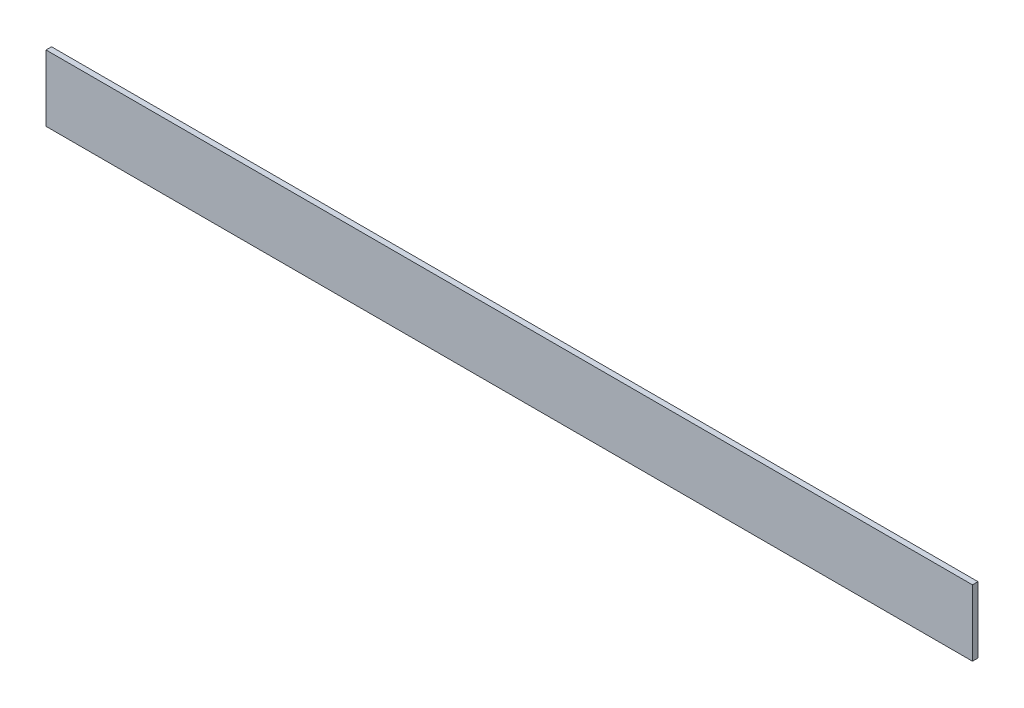
ISO-10303-21;
HEADER;
FILE_DESCRIPTION(('STEP AP214'),'2;1');
FILE_NAME('part.step','',(''),(''),'','','');
FILE_SCHEMA(('AUTOMOTIVE_DESIGN { 1 0 10303 214 1 1 1 1 }'));
ENDSEC;
DATA;
#1=APPLICATION_CONTEXT('core data for automotive mechanical design processes');
#2=APPLICATION_PROTOCOL_DEFINITION('international standard','automotive_design',2000,#1);
#3=PRODUCT_CONTEXT('',#1,'mechanical');
#4=PRODUCT('Part','Part','',(#3));
#5=PRODUCT_RELATED_PRODUCT_CATEGORY('part','',(#4));
#6=PRODUCT_DEFINITION_FORMATION('','',#4);
#7=PRODUCT_DEFINITION_CONTEXT('part definition',#1,'design');
#8=PRODUCT_DEFINITION('design','',#6,#7);
#9=PRODUCT_DEFINITION_SHAPE('','',#8);
#10=(LENGTH_UNIT() NAMED_UNIT(*) SI_UNIT(.MILLI.,.METRE.));
#11=(NAMED_UNIT(*) PLANE_ANGLE_UNIT() SI_UNIT($,.RADIAN.));
#12=(NAMED_UNIT(*) SI_UNIT($,.STERADIAN.) SOLID_ANGLE_UNIT());
#13=UNCERTAINTY_MEASURE_WITH_UNIT(LENGTH_MEASURE(1.E-05),#10,'distance_accuracy_value','');
#14=(GEOMETRIC_REPRESENTATION_CONTEXT(3) GLOBAL_UNCERTAINTY_ASSIGNED_CONTEXT((#13)) GLOBAL_UNIT_ASSIGNED_CONTEXT((#10,
#11,#12)) REPRESENTATION_CONTEXT('',''));
#15=CARTESIAN_POINT('',(0.,0.,0.));
#16=DIRECTION('',(0.,0.,1.));
#17=DIRECTION('',(1.,0.,0.));
#18=AXIS2_PLACEMENT_3D('',#15,#16,#17);
#19=CARTESIAN_POINT('',(1066.8,-38.1,-3.175));
#20=DIRECTION('',(0.,0.,1.));
#21=DIRECTION('',(1.,0.,0.));
#22=AXIS2_PLACEMENT_3D('',#19,#20,#21);
#23=PLANE('',#22);
#24=DIRECTION('',(0.,1.,0.));
#25=VECTOR('',#24,1.);
#26=CARTESIAN_POINT('',(0.,-38.1,-3.175));
#27=LINE('',#26,#25);
#28=CARTESIAN_POINT('',(0.,-38.1,-3.175));
#29=VERTEX_POINT('',#28);
#30=CARTESIAN_POINT('',(0.,38.1,-3.175));
#31=VERTEX_POINT('',#30);
#32=EDGE_CURVE('E98',#29,#31,#27,.T.);
#33=ORIENTED_EDGE('',*,*,#32,.T.);
#34=DIRECTION('',(-1.,0.,0.));
#35=VECTOR('',#34,1.);
#36=CARTESIAN_POINT('',(1066.8,38.1,-3.175));
#37=LINE('',#36,#35);
#38=CARTESIAN_POINT('',(1066.8,38.1,-3.175));
#39=VERTEX_POINT('',#38);
#40=EDGE_CURVE('E11',#39,#31,#37,.T.);
#41=ORIENTED_EDGE('',*,*,#40,.F.);
#42=DIRECTION('',(0.,1.,0.));
#43=VECTOR('',#42,1.);
#44=CARTESIAN_POINT('',(1066.8,-38.1,-3.175));
#45=LINE('',#44,#43);
#46=CARTESIAN_POINT('',(1066.8,-38.1,-3.175));
#47=VERTEX_POINT('',#46);
#48=EDGE_CURVE('E86',#47,#39,#45,.T.);
#49=ORIENTED_EDGE('',*,*,#48,.F.);
#50=DIRECTION('',(-1.,0.,0.));
#51=VECTOR('',#50,1.);
#52=CARTESIAN_POINT('',(1066.8,-38.1,-3.175));
#53=LINE('',#52,#51);
#54=EDGE_CURVE('E94',#47,#29,#53,.T.);
#55=ORIENTED_EDGE('',*,*,#54,.T.);
#56=EDGE_LOOP('',(#33,#41,#49,#55));
#57=FACE_BOUND('',#56,.T.);
#58=ADVANCED_FACE('F35',(#57),#23,.F.);
#59=CARTESIAN_POINT('',(1066.8,38.1,3.175));
#60=DIRECTION('',(0.,-1.,0.));
#61=DIRECTION('',(0.,0.,-1.));
#62=AXIS2_PLACEMENT_3D('',#59,#60,#61);
#63=PLANE('',#62);
#64=DIRECTION('',(0.,0.,1.));
#65=VECTOR('',#64,1.);
#66=CARTESIAN_POINT('',(0.,38.1,3.175));
#67=LINE('',#66,#65);
#68=CARTESIAN_POINT('',(0.,38.1,3.175));
#69=VERTEX_POINT('',#68);
#70=EDGE_CURVE('E90',#31,#69,#67,.T.);
#71=ORIENTED_EDGE('',*,*,#70,.T.);
#72=DIRECTION('',(-1.,0.,0.));
#73=VECTOR('',#72,1.);
#74=CARTESIAN_POINT('',(1066.8,38.1,3.175));
#75=LINE('',#74,#73);
#76=CARTESIAN_POINT('',(1066.8,38.1,3.175));
#77=VERTEX_POINT('',#76);
#78=EDGE_CURVE('E43',#77,#69,#75,.T.);
#79=ORIENTED_EDGE('',*,*,#78,.F.);
#80=DIRECTION('',(0.,0.,1.));
#81=VECTOR('',#80,1.);
#82=CARTESIAN_POINT('',(1066.8,38.1,3.175));
#83=LINE('',#82,#81);
#84=EDGE_CURVE('E81',#39,#77,#83,.T.);
#85=ORIENTED_EDGE('',*,*,#84,.F.);
#86=ORIENTED_EDGE('',*,*,#40,.T.);
#87=EDGE_LOOP('',(#71,#79,#85,#86));
#88=FACE_BOUND('',#87,.T.);
#89=ADVANCED_FACE('F89',(#88),#63,.F.);
#90=CARTESIAN_POINT('',(1066.8,-38.1,3.175));
#91=DIRECTION('',(0.,0.,-1.));
#92=DIRECTION('',(-1.,0.,0.));
#93=AXIS2_PLACEMENT_3D('',#90,#91,#92);
#94=PLANE('',#93);
#95=DIRECTION('',(0.,-1.,0.));
#96=VECTOR('',#95,1.);
#97=CARTESIAN_POINT('',(0.,-38.1,3.175));
#98=LINE('',#97,#96);
#99=CARTESIAN_POINT('',(0.,-38.1,3.175));
#100=VERTEX_POINT('',#99);
#101=EDGE_CURVE('E68',#69,#100,#98,.T.);
#102=ORIENTED_EDGE('',*,*,#101,.T.);
#103=DIRECTION('',(-1.,0.,0.));
#104=VECTOR('',#103,1.);
#105=CARTESIAN_POINT('',(1066.8,-38.1,3.175));
#106=LINE('',#105,#104);
#107=CARTESIAN_POINT('',(1066.8,-38.1,3.175));
#108=VERTEX_POINT('',#107);
#109=EDGE_CURVE('E91',#108,#100,#106,.T.);
#110=ORIENTED_EDGE('',*,*,#109,.F.);
#111=DIRECTION('',(0.,-1.,0.));
#112=VECTOR('',#111,1.);
#113=CARTESIAN_POINT('',(1066.8,-38.1,3.175));
#114=LINE('',#113,#112);
#115=EDGE_CURVE('E84',#77,#108,#114,.T.);
#116=ORIENTED_EDGE('',*,*,#115,.F.);
#117=ORIENTED_EDGE('',*,*,#78,.T.);
#118=EDGE_LOOP('',(#102,#110,#116,#117));
#119=FACE_BOUND('',#118,.T.);
#120=ADVANCED_FACE('F92',(#119),#94,.F.);
#121=CARTESIAN_POINT('',(1066.8,-38.1,3.175));
#122=DIRECTION('',(0.,1.,0.));
#123=DIRECTION('',(0.,0.,1.));
#124=AXIS2_PLACEMENT_3D('',#121,#122,#123);
#125=PLANE('',#124);
#126=DIRECTION('',(0.,0.,-1.));
#127=VECTOR('',#126,1.);
#128=CARTESIAN_POINT('',(0.,-38.1,3.175));
#129=LINE('',#128,#127);
#130=EDGE_CURVE('E74',#100,#29,#129,.T.);
#131=ORIENTED_EDGE('',*,*,#130,.T.);
#132=ORIENTED_EDGE('',*,*,#54,.F.);
#133=DIRECTION('',(0.,0.,-1.));
#134=VECTOR('',#133,1.);
#135=CARTESIAN_POINT('',(1066.8,-38.1,3.175));
#136=LINE('',#135,#134);
#137=EDGE_CURVE('E51',#108,#47,#136,.T.);
#138=ORIENTED_EDGE('',*,*,#137,.F.);
#139=ORIENTED_EDGE('',*,*,#109,.T.);
#140=EDGE_LOOP('',(#131,#132,#138,#139));
#141=FACE_BOUND('',#140,.T.);
#142=ADVANCED_FACE('F105',(#141),#125,.F.);
#143=CARTESIAN_POINT('',(1066.8,0.,0.));
#144=DIRECTION('',(-1.,0.,0.));
#145=DIRECTION('',(0.,0.,1.));
#146=AXIS2_PLACEMENT_3D('',#143,#144,#145);
#147=PLANE('',#146);
#148=ORIENTED_EDGE('',*,*,#48,.T.);
#149=ORIENTED_EDGE('',*,*,#84,.T.);
#150=ORIENTED_EDGE('',*,*,#115,.T.);
#151=ORIENTED_EDGE('',*,*,#137,.T.);
#152=EDGE_LOOP('',(#148,#149,#150,#151));
#153=FACE_BOUND('',#152,.T.);
#154=ADVANCED_FACE('F82',(#153),#147,.F.);
#155=CARTESIAN_POINT('',(0.,0.,0.));
#156=DIRECTION('',(-1.,0.,0.));
#157=DIRECTION('',(0.,0.,1.));
#158=AXIS2_PLACEMENT_3D('',#155,#156,#157);
#159=PLANE('',#158);
#160=ORIENTED_EDGE('',*,*,#32,.F.);
#161=ORIENTED_EDGE('',*,*,#130,.F.);
#162=ORIENTED_EDGE('',*,*,#101,.F.);
#163=ORIENTED_EDGE('',*,*,#70,.F.);
#164=EDGE_LOOP('',(#160,#161,#162,#163));
#165=FACE_BOUND('',#164,.T.);
#166=ADVANCED_FACE('F108',(#165),#159,.T.);
#167=CLOSED_SHELL('',(#58,#89,#120,#142,#154,#166));
#168=MANIFOLD_SOLID_BREP('B2',#167);
#169=ADVANCED_BREP_SHAPE_REPRESENTATION('',(#18,#168),#14);
#170=SHAPE_DEFINITION_REPRESENTATION(#9,#169);
ENDSEC;
END-ISO-10303-21;
